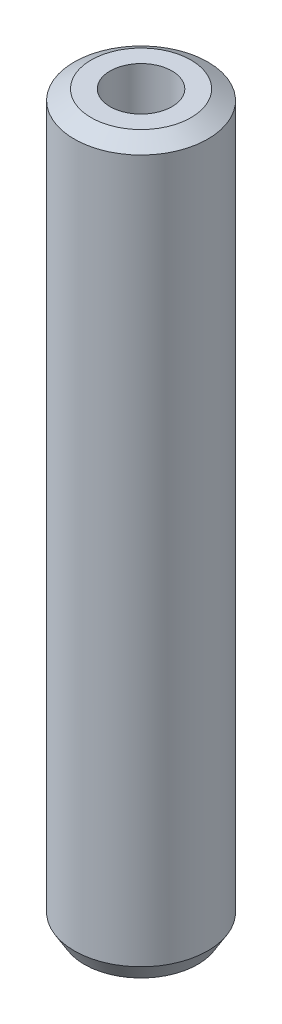
ISO-10303-21;
HEADER;
FILE_DESCRIPTION(('STEP AP214'),'2;1');
FILE_NAME('part.step','',(''),(''),'','','');
FILE_SCHEMA(('AUTOMOTIVE_DESIGN { 1 0 10303 214 1 1 1 1 }'));
ENDSEC;
DATA;
#1=APPLICATION_CONTEXT('core data for automotive mechanical design processes');
#2=APPLICATION_PROTOCOL_DEFINITION('international standard','automotive_design',2000,#1);
#3=PRODUCT_CONTEXT('',#1,'mechanical');
#4=PRODUCT('Part','Part','',(#3));
#5=PRODUCT_RELATED_PRODUCT_CATEGORY('part','',(#4));
#6=PRODUCT_DEFINITION_FORMATION('','',#4);
#7=PRODUCT_DEFINITION_CONTEXT('part definition',#1,'design');
#8=PRODUCT_DEFINITION('design','',#6,#7);
#9=PRODUCT_DEFINITION_SHAPE('','',#8);
#10=(LENGTH_UNIT() NAMED_UNIT(*) SI_UNIT(.MILLI.,.METRE.));
#11=(NAMED_UNIT(*) PLANE_ANGLE_UNIT() SI_UNIT($,.RADIAN.));
#12=(NAMED_UNIT(*) SI_UNIT($,.STERADIAN.) SOLID_ANGLE_UNIT());
#13=UNCERTAINTY_MEASURE_WITH_UNIT(LENGTH_MEASURE(1.E-05),#10,'distance_accuracy_value','');
#14=(GEOMETRIC_REPRESENTATION_CONTEXT(3) GLOBAL_UNCERTAINTY_ASSIGNED_CONTEXT((#13)) GLOBAL_UNIT_ASSIGNED_CONTEXT((#10,
#11,#12)) REPRESENTATION_CONTEXT('',''));
#15=CARTESIAN_POINT('',(0.,0.,0.));
#16=DIRECTION('',(0.,0.,1.));
#17=DIRECTION('',(1.,0.,0.));
#18=AXIS2_PLACEMENT_3D('',#15,#16,#17);
#19=CARTESIAN_POINT('',(0.,81.9372455824758,0.));
#20=DIRECTION('',(0.,-1.,0.));
#21=DIRECTION('',(0.,0.,-1.));
#22=AXIS2_PLACEMENT_3D('',#19,#20,#21);
#23=CYLINDRICAL_SURFACE('',#22,7.5);
#24=CARTESIAN_POINT('',(0.,80.8010524443182,0.));
#25=DIRECTION('',(0.,1.,0.));
#26=DIRECTION('',(0.,0.,1.));
#27=AXIS2_PLACEMENT_3D('',#24,#25,#26);
#28=CIRCLE('',#27,7.5);
#29=CARTESIAN_POINT('',(0.,80.8010524443182,-7.50000000000001));
#30=VERTEX_POINT('',#29);
#31=EDGE_CURVE('E50',#30,#30,#28,.F.);
#32=ORIENTED_EDGE('',*,*,#31,.T.);
#33=EDGE_LOOP('',(#32));
#34=FACE_BOUND('',#33,.T.);
#35=CARTESIAN_POINT('',(0.,1.89499175309089,0.));
#36=DIRECTION('',(0.,1.,0.));
#37=DIRECTION('',(0.,0.,1.));
#38=AXIS2_PLACEMENT_3D('',#35,#36,#37);
#39=CIRCLE('',#38,7.5);
#40=CARTESIAN_POINT('',(0.,1.89499175309089,7.5));
#41=VERTEX_POINT('',#40);
#42=EDGE_CURVE('E51',#41,#41,#39,.T.);
#43=ORIENTED_EDGE('',*,*,#42,.T.);
#44=EDGE_LOOP('',(#43));
#45=FACE_BOUND('',#44,.T.);
#46=ADVANCED_FACE('F39',(#34,#45),#23,.T.);
#47=CARTESIAN_POINT('',(0.,81.9372455824758,0.));
#48=DIRECTION('',(0.,1.,0.));
#49=DIRECTION('',(0.,0.,1.));
#50=AXIS2_PLACEMENT_3D('',#47,#48,#49);
#51=PLANE('',#50);
#52=CARTESIAN_POINT('',(0.,81.9372455824758,0.));
#53=DIRECTION('',(0.,1.,0.));
#54=DIRECTION('',(0.,0.,1.));
#55=AXIS2_PLACEMENT_3D('',#52,#53,#54);
#56=CIRCLE('',#55,5.60500824690904);
#57=CARTESIAN_POINT('',(0.,81.9372455824758,-5.60500824690905));
#58=VERTEX_POINT('',#57);
#59=EDGE_CURVE('E54',#58,#58,#56,.T.);
#60=ORIENTED_EDGE('',*,*,#59,.T.);
#61=EDGE_LOOP('',(#60));
#62=FACE_BOUND('',#61,.T.);
#63=CARTESIAN_POINT('',(0.,81.9372455824758,0.));
#64=DIRECTION('',(0.,1.,0.));
#65=DIRECTION('',(0.,0.,1.));
#66=AXIS2_PLACEMENT_3D('',#63,#64,#65);
#67=CIRCLE('',#66,3.475646885384);
#68=CARTESIAN_POINT('',(0.,81.9372455824758,3.475646885384));
#69=VERTEX_POINT('',#68);
#70=EDGE_CURVE('E58',#69,#69,#67,.T.);
#71=ORIENTED_EDGE('',*,*,#70,.F.);
#72=EDGE_LOOP('',(#71));
#73=FACE_BOUND('',#72,.T.);
#74=ADVANCED_FACE('F69',(#62,#73),#51,.T.);
#75=CARTESIAN_POINT('',(0.,0.,0.));
#76=DIRECTION('',(0.,1.,0.));
#77=DIRECTION('',(0.,0.,1.));
#78=AXIS2_PLACEMENT_3D('',#75,#76,#77);
#79=PLANE('',#78);
#80=CARTESIAN_POINT('',(0.,0.,0.));
#81=DIRECTION('',(0.,1.,0.));
#82=DIRECTION('',(0.,0.,1.));
#83=AXIS2_PLACEMENT_3D('',#80,#81,#82);
#84=CIRCLE('',#83,6.36380686184251);
#85=CARTESIAN_POINT('',(0.,0.,6.36380686184251));
#86=VERTEX_POINT('',#85);
#87=EDGE_CURVE('E10',#86,#86,#84,.F.);
#88=ORIENTED_EDGE('',*,*,#87,.T.);
#89=EDGE_LOOP('',(#88));
#90=FACE_BOUND('',#89,.T.);
#91=CARTESIAN_POINT('',(0.,0.,0.));
#92=DIRECTION('',(0.,1.,0.));
#93=DIRECTION('',(0.,0.,1.));
#94=AXIS2_PLACEMENT_3D('',#91,#92,#93);
#95=CIRCLE('',#94,3.475646885384);
#96=CARTESIAN_POINT('',(0.,0.,3.475646885384));
#97=VERTEX_POINT('',#96);
#98=EDGE_CURVE('E63',#97,#97,#95,.T.);
#99=ORIENTED_EDGE('',*,*,#98,.T.);
#100=EDGE_LOOP('',(#99));
#101=FACE_BOUND('',#100,.T.);
#102=ADVANCED_FACE('F75',(#90,#101),#79,.F.);
#103=CARTESIAN_POINT('',(0.,81.9372455824758,0.));
#104=DIRECTION('',(0.,-1.,0.));
#105=DIRECTION('',(0.,0.,-1.));
#106=AXIS2_PLACEMENT_3D('',#103,#104,#105);
#107=CYLINDRICAL_SURFACE('',#106,3.475646885384);
#108=ORIENTED_EDGE('',*,*,#70,.T.);
#109=EDGE_LOOP('',(#108));
#110=FACE_BOUND('',#109,.T.);
#111=ORIENTED_EDGE('',*,*,#98,.F.);
#112=EDGE_LOOP('',(#111));
#113=FACE_BOUND('',#112,.T.);
#114=ADVANCED_FACE('F70',(#110,#113),#107,.F.);
#115=CARTESIAN_POINT('',(0.,81.9372455824758,0.));
#116=DIRECTION('',(0.,-1.,0.));
#117=DIRECTION('',(0.,0.,-1.));
#118=AXIS2_PLACEMENT_3D('',#115,#116,#117);
#119=CONICAL_SURFACE('',#118,5.60500824690904,1.03068804292308);
#120=CARTESIAN_POINT('',(0.,80.8010524443182,-7.50000000000001));
#121=CARTESIAN_POINT('',(0.,80.8128877895073,-7.48026050257198));
#122=CARTESIAN_POINT('',(0.,80.8247231346965,-7.46052100514395));
#123=CARTESIAN_POINT('',(0.,80.8483938250748,-7.42104201028789));
#124=CARTESIAN_POINT('',(0.,80.8602291702639,-7.40130251285986));
#125=CARTESIAN_POINT('',(0.,80.8838998606422,-7.3618235180038));
#126=CARTESIAN_POINT('',(0.,80.8957352058313,-7.34208402057576));
#127=CARTESIAN_POINT('',(0.,80.9194058962096,-7.3026050257197));
#128=CARTESIAN_POINT('',(0.,80.9312412413988,-7.28286552829167));
#129=CARTESIAN_POINT('',(0.,80.954911931777,-7.24338653343561));
#130=CARTESIAN_POINT('',(0.,80.9667472769662,-7.22364703600758));
#131=CARTESIAN_POINT('',(0.,80.9904179673445,-7.18416804115152));
#132=CARTESIAN_POINT('',(0.,81.0022533125336,-7.16442854372349));
#133=CARTESIAN_POINT('',(0.,81.0259240029119,-7.12494954886743));
#134=CARTESIAN_POINT('',(0.,81.037759348101,-7.1052100514394));
#135=CARTESIAN_POINT('',(0.,81.0614300384793,-7.06573105658333));
#136=CARTESIAN_POINT('',(0.,81.0732653836685,-7.0459915591553));
#137=CARTESIAN_POINT('',(0.,81.0969360740467,-7.00651256429924));
#138=CARTESIAN_POINT('',(0.,81.1087714192359,-6.98677306687121));
#139=CARTESIAN_POINT('',(0.,81.1324421096142,-6.94729407201515));
#140=CARTESIAN_POINT('',(0.,81.1442774548033,-6.92755457458712));
#141=CARTESIAN_POINT('',(0.,81.1679481451816,-6.88807557973105));
#142=CARTESIAN_POINT('',(0.,81.1797834903707,-6.86833608230303));
#143=CARTESIAN_POINT('',(0.,81.203454180749,-6.82885708744696));
#144=CARTESIAN_POINT('',(0.,81.2152895259381,-6.80911759001893));
#145=CARTESIAN_POINT('',(0.,81.2389602163164,-6.76963859516287));
#146=CARTESIAN_POINT('',(0.,81.2507955615056,-6.74989909773484));
#147=CARTESIAN_POINT('',(0.,81.2744662518839,-6.71042010287878));
#148=CARTESIAN_POINT('',(0.,81.286301597073,-6.69068060545075));
#149=CARTESIAN_POINT('',(0.,81.3099722874513,-6.65120161059469));
#150=CARTESIAN_POINT('',(0.,81.3218076326404,-6.63146211316666));
#151=CARTESIAN_POINT('',(0.,81.3454783230187,-6.59198311831059));
#152=CARTESIAN_POINT('',(0.,81.3573136682078,-6.57224362088256));
#153=CARTESIAN_POINT('',(0.,81.3809843585861,-6.5327646260265));
#154=CARTESIAN_POINT('',(0.,81.3928197037753,-6.51302512859847));
#155=CARTESIAN_POINT('',(0.,81.4164903941536,-6.47354613374241));
#156=CARTESIAN_POINT('',(0.,81.4283257393427,-6.45380663631438));
#157=CARTESIAN_POINT('',(0.,81.451996429721,-6.41432764145832));
#158=CARTESIAN_POINT('',(0.,81.4638317749101,-6.39458814403029));
#159=CARTESIAN_POINT('',(0.,81.4875024652884,-6.35510914917423));
#160=CARTESIAN_POINT('',(0.,81.4993378104775,-6.33536965174619));
#161=CARTESIAN_POINT('',(0.,81.5230085008558,-6.29589065689013));
#162=CARTESIAN_POINT('',(0.,81.534843846045,-6.2761511594621));
#163=CARTESIAN_POINT('',(0.,81.5585145364232,-6.23667216460604));
#164=CARTESIAN_POINT('',(0.,81.5703498816124,-6.21693266717801));
#165=CARTESIAN_POINT('',(0.,81.5940205719907,-6.17745367232195));
#166=CARTESIAN_POINT('',(0.,81.6058559171798,-6.15771417489392));
#167=CARTESIAN_POINT('',(0.,81.6295266075581,-6.11823518003786));
#168=CARTESIAN_POINT('',(0.,81.6413619527472,-6.09849568260983));
#169=CARTESIAN_POINT('',(0.,81.6650326431255,-6.05901668775376));
#170=CARTESIAN_POINT('',(0.,81.6768679883146,-6.03927719032573));
#171=CARTESIAN_POINT('',(0.,81.7005386786929,-5.99979819546967));
#172=CARTESIAN_POINT('',(0.,81.7123740238821,-5.98005869804164));
#173=CARTESIAN_POINT('',(0.,81.7360447142604,-5.94057970318558));
#174=CARTESIAN_POINT('',(0.,81.7478800594495,-5.92084020575755));
#175=CARTESIAN_POINT('',(0.,81.7715507498278,-5.88136121090149));
#176=CARTESIAN_POINT('',(0.,81.7833860950169,-5.86162171347345));
#177=CARTESIAN_POINT('',(0.,81.8070567853952,-5.82214271861739));
#178=CARTESIAN_POINT('',(0.,81.8188921305843,-5.80240322118936));
#179=CARTESIAN_POINT('',(0.,81.8425628209626,-5.7629242263333));
#180=CARTESIAN_POINT('',(0.,81.8543981661518,-5.74318472890527));
#181=CARTESIAN_POINT('',(0.,81.87806885653,-5.70370573404921));
#182=CARTESIAN_POINT('',(0.,81.8899042017192,-5.68396623662118));
#183=CARTESIAN_POINT('',(0.,81.9135748920975,-5.64448724176512));
#184=CARTESIAN_POINT('',(0.,81.9254102372866,-5.62474774433709));
#185=CARTESIAN_POINT('',(0.,81.9372455824758,-5.60500824690905));
#186=B_SPLINE_CURVE_WITH_KNOTS('',3,(#120,#121,#122,#123,#124,#125,#126,#127,#128,#129,#130,
#131,#132,#133,#134,#135,#136,#137,#138,#139,#140,#141,#142,#143,#144,#145,#146,#147,#148,#149,
#150,#151,#152,#153,#154,#155,#156,#157,#158,#159,#160,#161,#162,#163,#164,#165,#166,#167,#168,
#169,#170,#171,#172,#173,#174,#175,#176,#177,#178,#179,#180,#181,#182,#183,#184,#185),
.UNSPECIFIED.,.F.,.F.,(4,2,2,2,2,2,2,2,2,2,2,2,2,2,2,2,2,2,2,2,2,2,2,2,2,2,2,2,2,2,2,2,4),(0.,
0.0690471461402689,0.138094292280544,0.207141438420813,0.276188584561089,0.345235730701358,
0.414282876841634,0.48333002298191,0.552377169122178,0.621424315262454,0.690471461402723,
0.759518607542999,0.828565753683275,0.897612899823543,0.966660045963819,1.03570719210409,
1.10475433824436,1.17380148438464,1.24284863052491,1.31189577666518,1.38094292280545,
1.44999006894573,1.519037215086,1.58808436122627,1.65713150736655,1.72617865350682,
1.79522579964709,1.86427294578737,1.93332009192764,2.00236723806791,2.07141438420818,
2.14046153034846,2.20950867648874),.UNSPECIFIED.);
#187=EDGE_CURVE('BSEAM81',#30,#58,#186,.T.);
#188=ORIENTED_EDGE('',*,*,#31,.F.);
#189=ORIENTED_EDGE('',*,*,#59,.F.);
#190=ORIENTED_EDGE('',*,*,#187,.T.);
#191=ORIENTED_EDGE('',*,*,#187,.F.);
#192=EDGE_LOOP('',(#188,#190,#189,#191));
#193=FACE_BOUND('',#192,.T.);
#194=ADVANCED_FACE('F81',(#193),#119,.T.);
#195=CARTESIAN_POINT('',(0.,1.89499175309089,0.));
#196=DIRECTION('',(0.,1.,0.));
#197=DIRECTION('',(0.,0.,1.));
#198=AXIS2_PLACEMENT_3D('',#195,#196,#197);
#199=CONICAL_SURFACE('',#198,7.5,0.540108283871812);
#200=ORIENTED_EDGE('',*,*,#87,.F.);
#201=EDGE_LOOP('',(#200));
#202=FACE_BOUND('',#201,.T.);
#203=ORIENTED_EDGE('',*,*,#42,.F.);
#204=EDGE_LOOP('',(#203));
#205=FACE_BOUND('',#204,.T.);
#206=ADVANCED_FACE('F45',(#202,#205),#199,.T.);
#207=CLOSED_SHELL('',(#46,#74,#102,#114,#194,#206));
#208=MANIFOLD_SOLID_BREP('B2',#207);
#209=ADVANCED_BREP_SHAPE_REPRESENTATION('',(#18,#208),#14);
#210=SHAPE_DEFINITION_REPRESENTATION(#9,#209);
ENDSEC;
END-ISO-10303-21;
